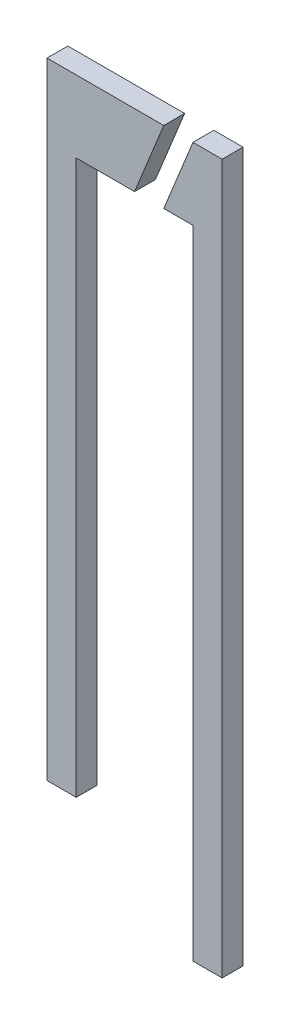
ISO-10303-21;
HEADER;
FILE_DESCRIPTION(('STEP AP214'),'2;1');
FILE_NAME('part.step','',(''),(''),'','','');
FILE_SCHEMA(('AUTOMOTIVE_DESIGN { 1 0 10303 214 1 1 1 1 }'));
ENDSEC;
DATA;
#1=APPLICATION_CONTEXT('core data for automotive mechanical design processes');
#2=APPLICATION_PROTOCOL_DEFINITION('international standard','automotive_design',2000,#1);
#3=PRODUCT_CONTEXT('',#1,'mechanical');
#4=PRODUCT('Part','Part','',(#3));
#5=PRODUCT_RELATED_PRODUCT_CATEGORY('part','',(#4));
#6=PRODUCT_DEFINITION_FORMATION('','',#4);
#7=PRODUCT_DEFINITION_CONTEXT('part definition',#1,'design');
#8=PRODUCT_DEFINITION('design','',#6,#7);
#9=PRODUCT_DEFINITION_SHAPE('','',#8);
#10=(LENGTH_UNIT() NAMED_UNIT(*) SI_UNIT(.MILLI.,.METRE.));
#11=(NAMED_UNIT(*) PLANE_ANGLE_UNIT() SI_UNIT($,.RADIAN.));
#12=(NAMED_UNIT(*) SI_UNIT($,.STERADIAN.) SOLID_ANGLE_UNIT());
#13=UNCERTAINTY_MEASURE_WITH_UNIT(LENGTH_MEASURE(1.E-05),#10,'distance_accuracy_value','');
#14=(GEOMETRIC_REPRESENTATION_CONTEXT(3) GLOBAL_UNCERTAINTY_ASSIGNED_CONTEXT((#13)) GLOBAL_UNIT_ASSIGNED_CONTEXT((#10,
#11,#12)) REPRESENTATION_CONTEXT('',''));
#15=CARTESIAN_POINT('',(0.,0.,0.));
#16=DIRECTION('',(0.,0.,1.));
#17=DIRECTION('',(1.,0.,0.));
#18=AXIS2_PLACEMENT_3D('',#15,#16,#17);
#19=CARTESIAN_POINT('',(-2.1,15.2750079730687,0.5));
#20=DIRECTION('',(0.,-1.,0.));
#21=DIRECTION('',(1.,0.,0.));
#22=AXIS2_PLACEMENT_3D('',#19,#20,#21);
#23=PLANE('',#22);
#24=DIRECTION('',(-1.,0.,0.));
#25=VECTOR('',#24,1.);
#26=CARTESIAN_POINT('',(-2.1,15.2750079730687,0.));
#27=LINE('',#26,#25);
#28=CARTESIAN_POINT('',(0.700000000000001,15.2750079730687,0.));
#29=VERTEX_POINT('',#28);
#30=CARTESIAN_POINT('',(-2.1,15.2750079730687,0.));
#31=VERTEX_POINT('',#30);
#32=EDGE_CURVE('E126',#29,#31,#27,.T.);
#33=ORIENTED_EDGE('',*,*,#32,.T.);
#34=DIRECTION('',(0.,0.,-1.));
#35=VECTOR('',#34,1.);
#36=CARTESIAN_POINT('',(-2.1,15.2750079730687,0.5));
#37=LINE('',#36,#35);
#38=CARTESIAN_POINT('',(-2.1,15.2750079730687,0.5));
#39=VERTEX_POINT('',#38);
#40=EDGE_CURVE('E12',#39,#31,#37,.T.);
#41=ORIENTED_EDGE('',*,*,#40,.F.);
#42=DIRECTION('',(-1.,0.,0.));
#43=VECTOR('',#42,1.);
#44=CARTESIAN_POINT('',(-2.1,15.2750079730687,0.5));
#45=LINE('',#44,#43);
#46=CARTESIAN_POINT('',(0.700000000000001,15.2750079730687,0.5));
#47=VERTEX_POINT('',#46);
#48=EDGE_CURVE('E136',#47,#39,#45,.T.);
#49=ORIENTED_EDGE('',*,*,#48,.F.);
#50=DIRECTION('',(0.,0.,-1.));
#51=VECTOR('',#50,1.);
#52=CARTESIAN_POINT('',(0.700000000000001,15.2750079730687,0.5));
#53=LINE('',#52,#51);
#54=EDGE_CURVE('E122',#47,#29,#53,.T.);
#55=ORIENTED_EDGE('',*,*,#54,.T.);
#56=EDGE_LOOP('',(#33,#41,#49,#55));
#57=FACE_BOUND('',#56,.T.);
#58=ADVANCED_FACE('F42',(#57),#23,.F.);
#59=CARTESIAN_POINT('',(-2.1,0.275007973068745,0.5));
#60=DIRECTION('',(1.,0.,0.));
#61=DIRECTION('',(0.,0.,-1.));
#62=AXIS2_PLACEMENT_3D('',#59,#60,#61);
#63=PLANE('',#62);
#64=DIRECTION('',(0.,-1.,0.));
#65=VECTOR('',#64,1.);
#66=CARTESIAN_POINT('',(-2.1,0.275007973068745,0.));
#67=LINE('',#66,#65);
#68=CARTESIAN_POINT('',(-2.1,0.275007973068745,0.));
#69=VERTEX_POINT('',#68);
#70=EDGE_CURVE('E129',#31,#69,#67,.T.);
#71=ORIENTED_EDGE('',*,*,#70,.T.);
#72=DIRECTION('',(0.,0.,-1.));
#73=VECTOR('',#72,1.);
#74=CARTESIAN_POINT('',(-2.1,0.275007973068745,0.5));
#75=LINE('',#74,#73);
#76=CARTESIAN_POINT('',(-2.1,0.275007973068745,0.5));
#77=VERTEX_POINT('',#76);
#78=EDGE_CURVE('E50',#77,#69,#75,.T.);
#79=ORIENTED_EDGE('',*,*,#78,.F.);
#80=DIRECTION('',(0.,-1.,0.));
#81=VECTOR('',#80,1.);
#82=CARTESIAN_POINT('',(-2.1,0.275007973068745,0.5));
#83=LINE('',#82,#81);
#84=EDGE_CURVE('E95',#39,#77,#83,.T.);
#85=ORIENTED_EDGE('',*,*,#84,.F.);
#86=ORIENTED_EDGE('',*,*,#40,.T.);
#87=EDGE_LOOP('',(#71,#79,#85,#86));
#88=FACE_BOUND('',#87,.T.);
#89=ADVANCED_FACE('F160',(#88),#63,.F.);
#90=CARTESIAN_POINT('',(-1.4,0.275007973068745,0.5));
#91=DIRECTION('',(0.,1.,0.));
#92=DIRECTION('',(-1.,0.,0.));
#93=AXIS2_PLACEMENT_3D('',#90,#91,#92);
#94=PLANE('',#93);
#95=DIRECTION('',(1.,0.,0.));
#96=VECTOR('',#95,1.);
#97=CARTESIAN_POINT('',(-1.4,0.275007973068745,0.));
#98=LINE('',#97,#96);
#99=CARTESIAN_POINT('',(-1.4,0.275007973068745,0.));
#100=VERTEX_POINT('',#99);
#101=EDGE_CURVE('E131',#69,#100,#98,.T.);
#102=ORIENTED_EDGE('',*,*,#101,.T.);
#103=DIRECTION('',(0.,0.,-1.));
#104=VECTOR('',#103,1.);
#105=CARTESIAN_POINT('',(-1.4,0.275007973068745,0.5));
#106=LINE('',#105,#104);
#107=CARTESIAN_POINT('',(-1.4,0.275007973068745,0.5));
#108=VERTEX_POINT('',#107);
#109=EDGE_CURVE('E117',#108,#100,#106,.T.);
#110=ORIENTED_EDGE('',*,*,#109,.F.);
#111=DIRECTION('',(1.,0.,0.));
#112=VECTOR('',#111,1.);
#113=CARTESIAN_POINT('',(-1.4,0.275007973068745,0.5));
#114=LINE('',#113,#112);
#115=EDGE_CURVE('E108',#77,#108,#114,.T.);
#116=ORIENTED_EDGE('',*,*,#115,.F.);
#117=ORIENTED_EDGE('',*,*,#78,.T.);
#118=EDGE_LOOP('',(#102,#110,#116,#117));
#119=FACE_BOUND('',#118,.T.);
#120=ADVANCED_FACE('F142',(#119),#94,.F.);
#121=CARTESIAN_POINT('',(-1.4,13.551244435055,0.5));
#122=DIRECTION('',(-1.,0.,0.));
#123=DIRECTION('',(0.,-1.,0.));
#124=AXIS2_PLACEMENT_3D('',#121,#122,#123);
#125=PLANE('',#124);
#126=DIRECTION('',(0.,1.,0.));
#127=VECTOR('',#126,1.);
#128=CARTESIAN_POINT('',(-1.4,13.551244435055,0.));
#129=LINE('',#128,#127);
#130=CARTESIAN_POINT('',(-1.4,13.551244435055,0.));
#131=VERTEX_POINT('',#130);
#132=EDGE_CURVE('E116',#100,#131,#129,.T.);
#133=ORIENTED_EDGE('',*,*,#132,.T.);
#134=DIRECTION('',(0.,0.,-1.));
#135=VECTOR('',#134,1.);
#136=CARTESIAN_POINT('',(-1.4,13.551244435055,0.5));
#137=LINE('',#136,#135);
#138=CARTESIAN_POINT('',(-1.4,13.551244435055,0.5));
#139=VERTEX_POINT('',#138);
#140=EDGE_CURVE('E113',#139,#131,#137,.T.);
#141=ORIENTED_EDGE('',*,*,#140,.F.);
#142=DIRECTION('',(0.,1.,0.));
#143=VECTOR('',#142,1.);
#144=CARTESIAN_POINT('',(-1.4,13.551244435055,0.5));
#145=LINE('',#144,#143);
#146=EDGE_CURVE('E102',#108,#139,#145,.T.);
#147=ORIENTED_EDGE('',*,*,#146,.F.);
#148=ORIENTED_EDGE('',*,*,#109,.T.);
#149=EDGE_LOOP('',(#133,#141,#147,#148));
#150=FACE_BOUND('',#149,.T.);
#151=ADVANCED_FACE('F114',(#150),#125,.F.);
#152=CARTESIAN_POINT('',(0.,13.551244435055,0.5));
#153=DIRECTION('',(0.,1.,0.));
#154=DIRECTION('',(0.,0.,1.));
#155=AXIS2_PLACEMENT_3D('',#152,#153,#154);
#156=PLANE('',#155);
#157=DIRECTION('',(1.,0.,0.));
#158=VECTOR('',#157,1.);
#159=CARTESIAN_POINT('',(0.,13.551244435055,0.));
#160=LINE('',#159,#158);
#161=CARTESIAN_POINT('',(0.,13.551244435055,0.));
#162=VERTEX_POINT('',#161);
#163=EDGE_CURVE('E81',#131,#162,#160,.T.);
#164=ORIENTED_EDGE('',*,*,#163,.T.);
#165=DIRECTION('',(0.,0.,-1.));
#166=VECTOR('',#165,1.);
#167=CARTESIAN_POINT('',(0.,13.551244435055,0.5));
#168=LINE('',#167,#166);
#169=CARTESIAN_POINT('',(0.,13.551244435055,0.5));
#170=VERTEX_POINT('',#169);
#171=EDGE_CURVE('E118',#170,#162,#168,.T.);
#172=ORIENTED_EDGE('',*,*,#171,.F.);
#173=DIRECTION('',(1.,0.,0.));
#174=VECTOR('',#173,1.);
#175=CARTESIAN_POINT('',(0.,13.551244435055,0.5));
#176=LINE('',#175,#174);
#177=EDGE_CURVE('E106',#139,#170,#176,.T.);
#178=ORIENTED_EDGE('',*,*,#177,.F.);
#179=ORIENTED_EDGE('',*,*,#140,.T.);
#180=EDGE_LOOP('',(#164,#172,#178,#179));
#181=FACE_BOUND('',#180,.T.);
#182=ADVANCED_FACE('F120',(#181),#156,.F.);
#183=CARTESIAN_POINT('',(0.700000000000001,15.2750079730687,0.5));
#184=DIRECTION('',(-0.926518848244514,0.376248353946777,0.));
#185=DIRECTION('',(-0.376248353946777,-0.926518848244514,0.));
#186=AXIS2_PLACEMENT_3D('',#183,#184,#185);
#187=PLANE('',#186);
#188=DIRECTION('',(0.376248353946777,0.926518848244514,0.));
#189=VECTOR('',#188,1.);
#190=CARTESIAN_POINT('',(0.700000000000001,15.2750079730687,0.));
#191=LINE('',#190,#189);
#192=EDGE_CURVE('E87',#162,#29,#191,.T.);
#193=ORIENTED_EDGE('',*,*,#192,.T.);
#194=ORIENTED_EDGE('',*,*,#54,.F.);
#195=DIRECTION('',(0.376248353946777,0.926518848244514,0.));
#196=VECTOR('',#195,1.);
#197=CARTESIAN_POINT('',(0.700000000000001,15.2750079730687,0.5));
#198=LINE('',#197,#196);
#199=EDGE_CURVE('E58',#170,#47,#198,.T.);
#200=ORIENTED_EDGE('',*,*,#199,.F.);
#201=ORIENTED_EDGE('',*,*,#171,.T.);
#202=EDGE_LOOP('',(#193,#194,#200,#201));
#203=FACE_BOUND('',#202,.T.);
#204=ADVANCED_FACE('F149',(#203),#187,.F.);
#205=CARTESIAN_POINT('',(0.,0.,0.5));
#206=DIRECTION('',(0.,0.,-1.));
#207=DIRECTION('',(-1.,0.,0.));
#208=AXIS2_PLACEMENT_3D('',#205,#206,#207);
#209=PLANE('',#208);
#210=ORIENTED_EDGE('',*,*,#48,.T.);
#211=ORIENTED_EDGE('',*,*,#84,.T.);
#212=ORIENTED_EDGE('',*,*,#115,.T.);
#213=ORIENTED_EDGE('',*,*,#146,.T.);
#214=ORIENTED_EDGE('',*,*,#177,.T.);
#215=ORIENTED_EDGE('',*,*,#199,.T.);
#216=EDGE_LOOP('',(#210,#211,#212,#213,#214,#215));
#217=FACE_BOUND('',#216,.T.);
#218=ADVANCED_FACE('F104',(#217),#209,.F.);
#219=CARTESIAN_POINT('',(0.,0.,0.));
#220=DIRECTION('',(0.,0.,-1.));
#221=DIRECTION('',(-1.,0.,0.));
#222=AXIS2_PLACEMENT_3D('',#219,#220,#221);
#223=PLANE('',#222);
#224=ORIENTED_EDGE('',*,*,#32,.F.);
#225=ORIENTED_EDGE('',*,*,#192,.F.);
#226=ORIENTED_EDGE('',*,*,#163,.F.);
#227=ORIENTED_EDGE('',*,*,#132,.F.);
#228=ORIENTED_EDGE('',*,*,#101,.F.);
#229=ORIENTED_EDGE('',*,*,#70,.F.);
#230=EDGE_LOOP('',(#224,#225,#226,#227,#228,#229));
#231=FACE_BOUND('',#230,.T.);
#232=ADVANCED_FACE('F145',(#231),#223,.T.);
#233=CLOSED_SHELL('',(#58,#89,#120,#151,#182,#204,#218,#232));
#234=MANIFOLD_SOLID_BREP('B2',#233);
#235=CARTESIAN_POINT('',(1.4,-1.72499202693126,0.5));
#236=DIRECTION('',(0.,1.,0.));
#237=DIRECTION('',(-1.,0.,0.));
#238=AXIS2_PLACEMENT_3D('',#235,#236,#237);
#239=PLANE('',#238);
#240=DIRECTION('',(1.,0.,0.));
#241=VECTOR('',#240,1.);
#242=CARTESIAN_POINT('',(1.4,-1.72499202693126,0.));
#243=LINE('',#242,#241);
#244=CARTESIAN_POINT('',(1.4,-1.72499202693126,0.));
#245=VERTEX_POINT('',#244);
#246=CARTESIAN_POINT('',(2.1,-1.72499202693126,0.));
#247=VERTEX_POINT('',#246);
#248=EDGE_CURVE('E301',#245,#247,#243,.T.);
#249=ORIENTED_EDGE('',*,*,#248,.T.);
#250=DIRECTION('',(0.,0.,-1.));
#251=VECTOR('',#250,1.);
#252=CARTESIAN_POINT('',(2.1,-1.72499202693126,0.5));
#253=LINE('',#252,#251);
#254=CARTESIAN_POINT('',(2.1,-1.72499202693126,0.5));
#255=VERTEX_POINT('',#254);
#256=EDGE_CURVE('E40',#255,#247,#253,.T.);
#257=ORIENTED_EDGE('',*,*,#256,.F.);
#258=DIRECTION('',(1.,0.,0.));
#259=VECTOR('',#258,1.);
#260=CARTESIAN_POINT('',(1.4,-1.72499202693126,0.5));
#261=LINE('',#260,#259);
#262=CARTESIAN_POINT('',(1.4,-1.72499202693126,0.5));
#263=VERTEX_POINT('',#262);
#264=EDGE_CURVE('E311',#263,#255,#261,.T.);
#265=ORIENTED_EDGE('',*,*,#264,.F.);
#266=DIRECTION('',(0.,0.,-1.));
#267=VECTOR('',#266,1.);
#268=CARTESIAN_POINT('',(1.4,-1.72499202693126,0.5));
#269=LINE('',#268,#267);
#270=EDGE_CURVE('E297',#263,#245,#269,.T.);
#271=ORIENTED_EDGE('',*,*,#270,.T.);
#272=EDGE_LOOP('',(#249,#257,#265,#271));
#273=FACE_BOUND('',#272,.T.);
#274=ADVANCED_FACE('F217',(#273),#239,.F.);
#275=CARTESIAN_POINT('',(2.1,-1.72499202693126,0.5));
#276=DIRECTION('',(-1.,0.,0.));
#277=DIRECTION('',(0.,-1.,0.));
#278=AXIS2_PLACEMENT_3D('',#275,#276,#277);
#279=PLANE('',#278);
#280=DIRECTION('',(0.,1.,0.));
#281=VECTOR('',#280,1.);
#282=CARTESIAN_POINT('',(2.1,-1.72499202693126,0.));
#283=LINE('',#282,#281);
#284=CARTESIAN_POINT('',(2.1,15.2750079730687,0.));
#285=VERTEX_POINT('',#284);
#286=EDGE_CURVE('E304',#247,#285,#283,.T.);
#287=ORIENTED_EDGE('',*,*,#286,.T.);
#288=DIRECTION('',(0.,0.,-1.));
#289=VECTOR('',#288,1.);
#290=CARTESIAN_POINT('',(2.1,15.2750079730687,0.5));
#291=LINE('',#290,#289);
#292=CARTESIAN_POINT('',(2.1,15.2750079730687,0.5));
#293=VERTEX_POINT('',#292);
#294=EDGE_CURVE('E225',#293,#285,#291,.T.);
#295=ORIENTED_EDGE('',*,*,#294,.F.);
#296=DIRECTION('',(0.,1.,0.));
#297=VECTOR('',#296,1.);
#298=CARTESIAN_POINT('',(2.1,-1.72499202693126,0.5));
#299=LINE('',#298,#297);
#300=EDGE_CURVE('E270',#255,#293,#299,.T.);
#301=ORIENTED_EDGE('',*,*,#300,.F.);
#302=ORIENTED_EDGE('',*,*,#256,.T.);
#303=EDGE_LOOP('',(#287,#295,#301,#302));
#304=FACE_BOUND('',#303,.T.);
#305=ADVANCED_FACE('F335',(#304),#279,.F.);
#306=CARTESIAN_POINT('',(2.1,15.2750079730687,0.5));
#307=DIRECTION('',(0.,-1.,0.));
#308=DIRECTION('',(1.,0.,0.));
#309=AXIS2_PLACEMENT_3D('',#306,#307,#308);
#310=PLANE('',#309);
#311=DIRECTION('',(-1.,0.,0.));
#312=VECTOR('',#311,1.);
#313=CARTESIAN_POINT('',(2.1,15.2750079730687,0.));
#314=LINE('',#313,#312);
#315=CARTESIAN_POINT('',(1.4,15.2750079730687,0.));
#316=VERTEX_POINT('',#315);
#317=EDGE_CURVE('E306',#285,#316,#314,.T.);
#318=ORIENTED_EDGE('',*,*,#317,.T.);
#319=DIRECTION('',(0.,0.,-1.));
#320=VECTOR('',#319,1.);
#321=CARTESIAN_POINT('',(1.4,15.2750079730687,0.5));
#322=LINE('',#321,#320);
#323=CARTESIAN_POINT('',(1.4,15.2750079730687,0.5));
#324=VERTEX_POINT('',#323);
#325=EDGE_CURVE('E292',#324,#316,#322,.T.);
#326=ORIENTED_EDGE('',*,*,#325,.F.);
#327=DIRECTION('',(-1.,0.,0.));
#328=VECTOR('',#327,1.);
#329=CARTESIAN_POINT('',(2.1,15.2750079730687,0.5));
#330=LINE('',#329,#328);
#331=EDGE_CURVE('E283',#293,#324,#330,.T.);
#332=ORIENTED_EDGE('',*,*,#331,.F.);
#333=ORIENTED_EDGE('',*,*,#294,.T.);
#334=EDGE_LOOP('',(#318,#326,#332,#333));
#335=FACE_BOUND('',#334,.T.);
#336=ADVANCED_FACE('F317',(#335),#310,.F.);
#337=CARTESIAN_POINT('',(1.4,15.2750079730687,0.5));
#338=DIRECTION('',(0.926518848244513,-0.37624835394678,0.));
#339=DIRECTION('',(0.37624835394678,0.926518848244513,0.));
#340=AXIS2_PLACEMENT_3D('',#337,#338,#339);
#341=PLANE('',#340);
#342=DIRECTION('',(-0.37624835394678,-0.926518848244513,0.));
#343=VECTOR('',#342,1.);
#344=CARTESIAN_POINT('',(1.4,15.2750079730687,0.));
#345=LINE('',#344,#343);
#346=CARTESIAN_POINT('',(0.699999999999994,13.551244435055,0.));
#347=VERTEX_POINT('',#346);
#348=EDGE_CURVE('E291',#316,#347,#345,.T.);
#349=ORIENTED_EDGE('',*,*,#348,.T.);
#350=DIRECTION('',(0.,0.,-1.));
#351=VECTOR('',#350,1.);
#352=CARTESIAN_POINT('',(0.699999999999994,13.551244435055,0.5));
#353=LINE('',#352,#351);
#354=CARTESIAN_POINT('',(0.699999999999994,13.551244435055,0.5));
#355=VERTEX_POINT('',#354);
#356=EDGE_CURVE('E288',#355,#347,#353,.T.);
#357=ORIENTED_EDGE('',*,*,#356,.F.);
#358=DIRECTION('',(-0.37624835394678,-0.926518848244513,0.));
#359=VECTOR('',#358,1.);
#360=CARTESIAN_POINT('',(1.4,15.2750079730687,0.5));
#361=LINE('',#360,#359);
#362=EDGE_CURVE('E277',#324,#355,#361,.T.);
#363=ORIENTED_EDGE('',*,*,#362,.F.);
#364=ORIENTED_EDGE('',*,*,#325,.T.);
#365=EDGE_LOOP('',(#349,#357,#363,#364));
#366=FACE_BOUND('',#365,.T.);
#367=ADVANCED_FACE('F289',(#366),#341,.F.);
#368=CARTESIAN_POINT('',(0.699999999999994,13.551244435055,0.5));
#369=DIRECTION('',(0.,1.,0.));
#370=DIRECTION('',(0.,0.,1.));
#371=AXIS2_PLACEMENT_3D('',#368,#369,#370);
#372=PLANE('',#371);
#373=DIRECTION('',(1.,0.,0.));
#374=VECTOR('',#373,1.);
#375=CARTESIAN_POINT('',(0.699999999999994,13.551244435055,0.));
#376=LINE('',#375,#374);
#377=CARTESIAN_POINT('',(1.39999999999999,13.551244435055,0.));
#378=VERTEX_POINT('',#377);
#379=EDGE_CURVE('E256',#347,#378,#376,.T.);
#380=ORIENTED_EDGE('',*,*,#379,.T.);
#381=DIRECTION('',(0.,0.,-1.));
#382=VECTOR('',#381,1.);
#383=CARTESIAN_POINT('',(1.39999999999999,13.551244435055,0.5));
#384=LINE('',#383,#382);
#385=CARTESIAN_POINT('',(1.39999999999999,13.551244435055,0.5));
#386=VERTEX_POINT('',#385);
#387=EDGE_CURVE('E293',#386,#378,#384,.T.);
#388=ORIENTED_EDGE('',*,*,#387,.F.);
#389=DIRECTION('',(1.,0.,0.));
#390=VECTOR('',#389,1.);
#391=CARTESIAN_POINT('',(0.699999999999994,13.551244435055,0.5));
#392=LINE('',#391,#390);
#393=EDGE_CURVE('E281',#355,#386,#392,.T.);
#394=ORIENTED_EDGE('',*,*,#393,.F.);
#395=ORIENTED_EDGE('',*,*,#356,.T.);
#396=EDGE_LOOP('',(#380,#388,#394,#395));
#397=FACE_BOUND('',#396,.T.);
#398=ADVANCED_FACE('F295',(#397),#372,.F.);
#399=CARTESIAN_POINT('',(1.39999999999999,13.551244435055,0.5));
#400=DIRECTION('',(1.,0.,0.));
#401=DIRECTION('',(0.,1.,0.));
#402=AXIS2_PLACEMENT_3D('',#399,#400,#401);
#403=PLANE('',#402);
#404=DIRECTION('',(0.,-1.,0.));
#405=VECTOR('',#404,1.);
#406=CARTESIAN_POINT('',(1.39999999999999,13.551244435055,0.));
#407=LINE('',#406,#405);
#408=EDGE_CURVE('E262',#378,#245,#407,.T.);
#409=ORIENTED_EDGE('',*,*,#408,.T.);
#410=ORIENTED_EDGE('',*,*,#270,.F.);
#411=DIRECTION('',(0.,-1.,0.));
#412=VECTOR('',#411,1.);
#413=CARTESIAN_POINT('',(1.39999999999999,13.551244435055,0.5));
#414=LINE('',#413,#412);
#415=EDGE_CURVE('E233',#386,#263,#414,.T.);
#416=ORIENTED_EDGE('',*,*,#415,.F.);
#417=ORIENTED_EDGE('',*,*,#387,.T.);
#418=EDGE_LOOP('',(#409,#410,#416,#417));
#419=FACE_BOUND('',#418,.T.);
#420=ADVANCED_FACE('F324',(#419),#403,.F.);
#421=CARTESIAN_POINT('',(0.,0.,0.5));
#422=DIRECTION('',(0.,0.,1.));
#423=DIRECTION('',(1.,0.,0.));
#424=AXIS2_PLACEMENT_3D('',#421,#422,#423);
#425=PLANE('',#424);
#426=ORIENTED_EDGE('',*,*,#264,.T.);
#427=ORIENTED_EDGE('',*,*,#300,.T.);
#428=ORIENTED_EDGE('',*,*,#331,.T.);
#429=ORIENTED_EDGE('',*,*,#362,.T.);
#430=ORIENTED_EDGE('',*,*,#393,.T.);
#431=ORIENTED_EDGE('',*,*,#415,.T.);
#432=EDGE_LOOP('',(#426,#427,#428,#429,#430,#431));
#433=FACE_BOUND('',#432,.T.);
#434=ADVANCED_FACE('F279',(#433),#425,.T.);
#435=CARTESIAN_POINT('',(0.,0.,0.));
#436=DIRECTION('',(0.,0.,1.));
#437=DIRECTION('',(1.,0.,0.));
#438=AXIS2_PLACEMENT_3D('',#435,#436,#437);
#439=PLANE('',#438);
#440=ORIENTED_EDGE('',*,*,#248,.F.);
#441=ORIENTED_EDGE('',*,*,#408,.F.);
#442=ORIENTED_EDGE('',*,*,#379,.F.);
#443=ORIENTED_EDGE('',*,*,#348,.F.);
#444=ORIENTED_EDGE('',*,*,#317,.F.);
#445=ORIENTED_EDGE('',*,*,#286,.F.);
#446=EDGE_LOOP('',(#440,#441,#442,#443,#444,#445));
#447=FACE_BOUND('',#446,.T.);
#448=ADVANCED_FACE('F320',(#447),#439,.F.);
#449=CLOSED_SHELL('',(#274,#305,#336,#367,#398,#420,#434,#448));
#450=MANIFOLD_SOLID_BREP('B6',#449);
#451=ADVANCED_BREP_SHAPE_REPRESENTATION('',(#18,#234,#450),#14);
#452=SHAPE_DEFINITION_REPRESENTATION(#9,#451);
ENDSEC;
END-ISO-10303-21;
